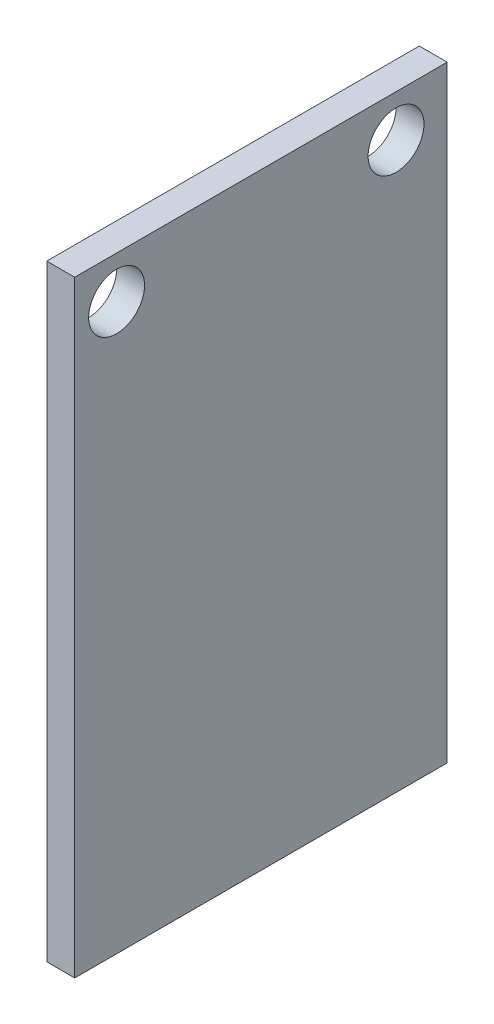
ISO-10303-21;
HEADER;
FILE_DESCRIPTION(('STEP AP214'),'2;1');
FILE_NAME('part.step','',(''),(''),'','','');
FILE_SCHEMA(('AUTOMOTIVE_DESIGN { 1 0 10303 214 1 1 1 1 }'));
ENDSEC;
DATA;
#1=APPLICATION_CONTEXT('core data for automotive mechanical design processes');
#2=APPLICATION_PROTOCOL_DEFINITION('international standard','automotive_design',2000,#1);
#3=PRODUCT_CONTEXT('',#1,'mechanical');
#4=PRODUCT('Part','Part','',(#3));
#5=PRODUCT_RELATED_PRODUCT_CATEGORY('part','',(#4));
#6=PRODUCT_DEFINITION_FORMATION('','',#4);
#7=PRODUCT_DEFINITION_CONTEXT('part definition',#1,'design');
#8=PRODUCT_DEFINITION('design','',#6,#7);
#9=PRODUCT_DEFINITION_SHAPE('','',#8);
#10=(LENGTH_UNIT() NAMED_UNIT(*) SI_UNIT(.MILLI.,.METRE.));
#11=(NAMED_UNIT(*) PLANE_ANGLE_UNIT() SI_UNIT($,.RADIAN.));
#12=(NAMED_UNIT(*) SI_UNIT($,.STERADIAN.) SOLID_ANGLE_UNIT());
#13=UNCERTAINTY_MEASURE_WITH_UNIT(LENGTH_MEASURE(1.E-05),#10,'distance_accuracy_value','');
#14=(GEOMETRIC_REPRESENTATION_CONTEXT(3) GLOBAL_UNCERTAINTY_ASSIGNED_CONTEXT((#13)) GLOBAL_UNIT_ASSIGNED_CONTEXT((#10,
#11,#12)) REPRESENTATION_CONTEXT('',''));
#15=CARTESIAN_POINT('',(0.,0.,0.));
#16=DIRECTION('',(0.,0.,1.));
#17=DIRECTION('',(1.,0.,0.));
#18=AXIS2_PLACEMENT_3D('',#15,#16,#17);
#19=CARTESIAN_POINT('',(1.5,0.,0.));
#20=DIRECTION('',(1.,0.,0.));
#21=DIRECTION('',(0.,0.,-1.));
#22=AXIS2_PLACEMENT_3D('',#19,#20,#21);
#23=PLANE('',#22);
#24=CARTESIAN_POINT('',(1.5,-2.25,-2.25));
#25=DIRECTION('',(1.,0.,0.));
#26=DIRECTION('',(0.,0.,-1.));
#27=AXIS2_PLACEMENT_3D('',#24,#25,#26);
#28=CIRCLE('',#27,1.5);
#29=CARTESIAN_POINT('',(1.5,-2.25,-3.75));
#30=VERTEX_POINT('',#29);
#31=EDGE_CURVE('E106',#30,#30,#28,.T.);
#32=ORIENTED_EDGE('',*,*,#31,.F.);
#33=EDGE_LOOP('',(#32));
#34=FACE_BOUND('',#33,.T.);
#35=DIRECTION('',(0.,-1.,0.));
#36=VECTOR('',#35,1.);
#37=CARTESIAN_POINT('',(1.5,0.,0.));
#38=LINE('',#37,#36);
#39=CARTESIAN_POINT('',(1.5,0.,0.));
#40=VERTEX_POINT('',#39);
#41=CARTESIAN_POINT('',(1.5,-32.58,0.));
#42=VERTEX_POINT('',#41);
#43=EDGE_CURVE('E91',#40,#42,#38,.T.);
#44=ORIENTED_EDGE('',*,*,#43,.T.);
#45=DIRECTION('',(0.,0.,-1.));
#46=VECTOR('',#45,1.);
#47=CARTESIAN_POINT('',(1.5,-32.58,0.));
#48=LINE('',#47,#46);
#49=CARTESIAN_POINT('',(1.5,-32.58,-20.));
#50=VERTEX_POINT('',#49);
#51=EDGE_CURVE('E86',#42,#50,#48,.T.);
#52=ORIENTED_EDGE('',*,*,#51,.T.);
#53=DIRECTION('',(0.,1.,0.));
#54=VECTOR('',#53,1.);
#55=CARTESIAN_POINT('',(1.5,0.,-20.));
#56=LINE('',#55,#54);
#57=CARTESIAN_POINT('',(1.5,0.,-20.));
#58=VERTEX_POINT('',#57);
#59=EDGE_CURVE('E89',#50,#58,#56,.T.);
#60=ORIENTED_EDGE('',*,*,#59,.T.);
#61=DIRECTION('',(0.,0.,1.));
#62=VECTOR('',#61,1.);
#63=CARTESIAN_POINT('',(1.5,0.,0.));
#64=LINE('',#63,#62);
#65=EDGE_CURVE('E56',#58,#40,#64,.T.);
#66=ORIENTED_EDGE('',*,*,#65,.T.);
#67=EDGE_LOOP('',(#44,#52,#60,#66));
#68=FACE_BOUND('',#67,.T.);
#69=CARTESIAN_POINT('',(1.5,-2.25,-17.25));
#70=DIRECTION('',(1.,0.,0.));
#71=DIRECTION('',(0.,0.,-1.));
#72=AXIS2_PLACEMENT_3D('',#69,#70,#71);
#73=CIRCLE('',#72,1.5);
#74=CARTESIAN_POINT('',(1.5,-2.25,-18.75));
#75=VERTEX_POINT('',#74);
#76=EDGE_CURVE('E121',#75,#75,#73,.T.);
#77=ORIENTED_EDGE('',*,*,#76,.F.);
#78=EDGE_LOOP('',(#77));
#79=FACE_BOUND('',#78,.T.);
#80=ADVANCED_FACE('F39',(#34,#68,#79),#23,.T.);
#81=CARTESIAN_POINT('',(0.,0.,0.));
#82=DIRECTION('',(1.,0.,0.));
#83=DIRECTION('',(0.,0.,-1.));
#84=AXIS2_PLACEMENT_3D('',#81,#82,#83);
#85=PLANE('',#84);
#86=DIRECTION('',(0.,-1.,0.));
#87=VECTOR('',#86,1.);
#88=CARTESIAN_POINT('',(0.,0.,0.));
#89=LINE('',#88,#87);
#90=CARTESIAN_POINT('',(0.,0.,0.));
#91=VERTEX_POINT('',#90);
#92=CARTESIAN_POINT('',(0.,-32.58,0.));
#93=VERTEX_POINT('',#92);
#94=EDGE_CURVE('E103',#91,#93,#89,.T.);
#95=ORIENTED_EDGE('',*,*,#94,.F.);
#96=DIRECTION('',(0.,0.,1.));
#97=VECTOR('',#96,1.);
#98=CARTESIAN_POINT('',(0.,0.,0.));
#99=LINE('',#98,#97);
#100=CARTESIAN_POINT('',(0.,0.,-20.));
#101=VERTEX_POINT('',#100);
#102=EDGE_CURVE('E79',#101,#91,#99,.T.);
#103=ORIENTED_EDGE('',*,*,#102,.F.);
#104=DIRECTION('',(0.,1.,0.));
#105=VECTOR('',#104,1.);
#106=CARTESIAN_POINT('',(0.,0.,-20.));
#107=LINE('',#106,#105);
#108=CARTESIAN_POINT('',(0.,-32.58,-20.));
#109=VERTEX_POINT('',#108);
#110=EDGE_CURVE('E73',#109,#101,#107,.T.);
#111=ORIENTED_EDGE('',*,*,#110,.F.);
#112=DIRECTION('',(0.,0.,-1.));
#113=VECTOR('',#112,1.);
#114=CARTESIAN_POINT('',(0.,-32.58,0.));
#115=LINE('',#114,#113);
#116=EDGE_CURVE('E95',#93,#109,#115,.T.);
#117=ORIENTED_EDGE('',*,*,#116,.F.);
#118=EDGE_LOOP('',(#95,#103,#111,#117));
#119=FACE_BOUND('',#118,.T.);
#120=CARTESIAN_POINT('',(0.,-2.25,-2.25));
#121=DIRECTION('',(1.,0.,0.));
#122=DIRECTION('',(0.,0.,-1.));
#123=AXIS2_PLACEMENT_3D('',#120,#121,#122);
#124=CIRCLE('',#123,1.5);
#125=CARTESIAN_POINT('',(0.,-2.25,-3.75));
#126=VERTEX_POINT('',#125);
#127=EDGE_CURVE('E118',#126,#126,#124,.T.);
#128=ORIENTED_EDGE('',*,*,#127,.T.);
#129=EDGE_LOOP('',(#128));
#130=FACE_BOUND('',#129,.T.);
#131=CARTESIAN_POINT('',(0.,-2.25,-17.25));
#132=DIRECTION('',(1.,0.,0.));
#133=DIRECTION('',(0.,0.,-1.));
#134=AXIS2_PLACEMENT_3D('',#131,#132,#133);
#135=CIRCLE('',#134,1.5);
#136=CARTESIAN_POINT('',(0.,-2.25,-18.75));
#137=VERTEX_POINT('',#136);
#138=EDGE_CURVE('E124',#137,#137,#135,.T.);
#139=ORIENTED_EDGE('',*,*,#138,.T.);
#140=EDGE_LOOP('',(#139));
#141=FACE_BOUND('',#140,.T.);
#142=ADVANCED_FACE('F114',(#119,#130,#141),#85,.F.);
#143=CARTESIAN_POINT('',(1.5,0.,0.));
#144=DIRECTION('',(0.,0.,-1.));
#145=DIRECTION('',(-1.,0.,0.));
#146=AXIS2_PLACEMENT_3D('',#143,#144,#145);
#147=PLANE('',#146);
#148=ORIENTED_EDGE('',*,*,#94,.T.);
#149=DIRECTION('',(-1.,0.,0.));
#150=VECTOR('',#149,1.);
#151=CARTESIAN_POINT('',(1.5,-32.58,0.));
#152=LINE('',#151,#150);
#153=EDGE_CURVE('E11',#42,#93,#152,.T.);
#154=ORIENTED_EDGE('',*,*,#153,.F.);
#155=ORIENTED_EDGE('',*,*,#43,.F.);
#156=DIRECTION('',(-1.,0.,0.));
#157=VECTOR('',#156,1.);
#158=CARTESIAN_POINT('',(1.5,0.,0.));
#159=LINE('',#158,#157);
#160=EDGE_CURVE('E99',#40,#91,#159,.T.);
#161=ORIENTED_EDGE('',*,*,#160,.T.);
#162=EDGE_LOOP('',(#148,#154,#155,#161));
#163=FACE_BOUND('',#162,.T.);
#164=ADVANCED_FACE('F41',(#163),#147,.F.);
#165=CARTESIAN_POINT('',(1.5,-32.58,0.));
#166=DIRECTION('',(0.,1.,0.));
#167=DIRECTION('',(0.,0.,1.));
#168=AXIS2_PLACEMENT_3D('',#165,#166,#167);
#169=PLANE('',#168);
#170=ORIENTED_EDGE('',*,*,#116,.T.);
#171=DIRECTION('',(-1.,0.,0.));
#172=VECTOR('',#171,1.);
#173=CARTESIAN_POINT('',(1.5,-32.58,-20.));
#174=LINE('',#173,#172);
#175=EDGE_CURVE('E48',#50,#109,#174,.T.);
#176=ORIENTED_EDGE('',*,*,#175,.F.);
#177=ORIENTED_EDGE('',*,*,#51,.F.);
#178=ORIENTED_EDGE('',*,*,#153,.T.);
#179=EDGE_LOOP('',(#170,#176,#177,#178));
#180=FACE_BOUND('',#179,.T.);
#181=ADVANCED_FACE('F94',(#180),#169,.F.);
#182=CARTESIAN_POINT('',(1.5,0.,-20.));
#183=DIRECTION('',(0.,0.,1.));
#184=DIRECTION('',(0.,-1.,0.));
#185=AXIS2_PLACEMENT_3D('',#182,#183,#184);
#186=PLANE('',#185);
#187=ORIENTED_EDGE('',*,*,#110,.T.);
#188=DIRECTION('',(-1.,0.,0.));
#189=VECTOR('',#188,1.);
#190=CARTESIAN_POINT('',(1.5,0.,-20.));
#191=LINE('',#190,#189);
#192=EDGE_CURVE('E96',#58,#101,#191,.T.);
#193=ORIENTED_EDGE('',*,*,#192,.F.);
#194=ORIENTED_EDGE('',*,*,#59,.F.);
#195=ORIENTED_EDGE('',*,*,#175,.T.);
#196=EDGE_LOOP('',(#187,#193,#194,#195));
#197=FACE_BOUND('',#196,.T.);
#198=ADVANCED_FACE('F97',(#197),#186,.F.);
#199=CARTESIAN_POINT('',(1.5,0.,0.));
#200=DIRECTION('',(0.,-1.,0.));
#201=DIRECTION('',(0.,0.,-1.));
#202=AXIS2_PLACEMENT_3D('',#199,#200,#201);
#203=PLANE('',#202);
#204=ORIENTED_EDGE('',*,*,#102,.T.);
#205=ORIENTED_EDGE('',*,*,#160,.F.);
#206=ORIENTED_EDGE('',*,*,#65,.F.);
#207=ORIENTED_EDGE('',*,*,#192,.T.);
#208=EDGE_LOOP('',(#204,#205,#206,#207));
#209=FACE_BOUND('',#208,.T.);
#210=ADVANCED_FACE('F111',(#209),#203,.F.);
#211=CARTESIAN_POINT('',(1.5,-2.25,-2.25));
#212=DIRECTION('',(-1.,0.,0.));
#213=DIRECTION('',(0.,0.,1.));
#214=AXIS2_PLACEMENT_3D('',#211,#212,#213);
#215=CYLINDRICAL_SURFACE('',#214,1.5);
#216=ORIENTED_EDGE('',*,*,#31,.T.);
#217=EDGE_LOOP('',(#216));
#218=FACE_BOUND('',#217,.T.);
#219=ORIENTED_EDGE('',*,*,#127,.F.);
#220=EDGE_LOOP('',(#219));
#221=FACE_BOUND('',#220,.T.);
#222=ADVANCED_FACE('F141',(#218,#221),#215,.F.);
#223=CARTESIAN_POINT('',(1.5,-2.25,-17.25));
#224=DIRECTION('',(-1.,0.,0.));
#225=DIRECTION('',(0.,0.,1.));
#226=AXIS2_PLACEMENT_3D('',#223,#224,#225);
#227=CYLINDRICAL_SURFACE('',#226,1.5);
#228=ORIENTED_EDGE('',*,*,#76,.T.);
#229=EDGE_LOOP('',(#228));
#230=FACE_BOUND('',#229,.T.);
#231=ORIENTED_EDGE('',*,*,#138,.F.);
#232=EDGE_LOOP('',(#231));
#233=FACE_BOUND('',#232,.T.);
#234=ADVANCED_FACE('F130',(#230,#233),#227,.F.);
#235=CLOSED_SHELL('',(#80,#142,#164,#181,#198,#210,#222,#234));
#236=MANIFOLD_SOLID_BREP('B2',#235);
#237=ADVANCED_BREP_SHAPE_REPRESENTATION('',(#18,#236),#14);
#238=SHAPE_DEFINITION_REPRESENTATION(#9,#237);
ENDSEC;
END-ISO-10303-21;
